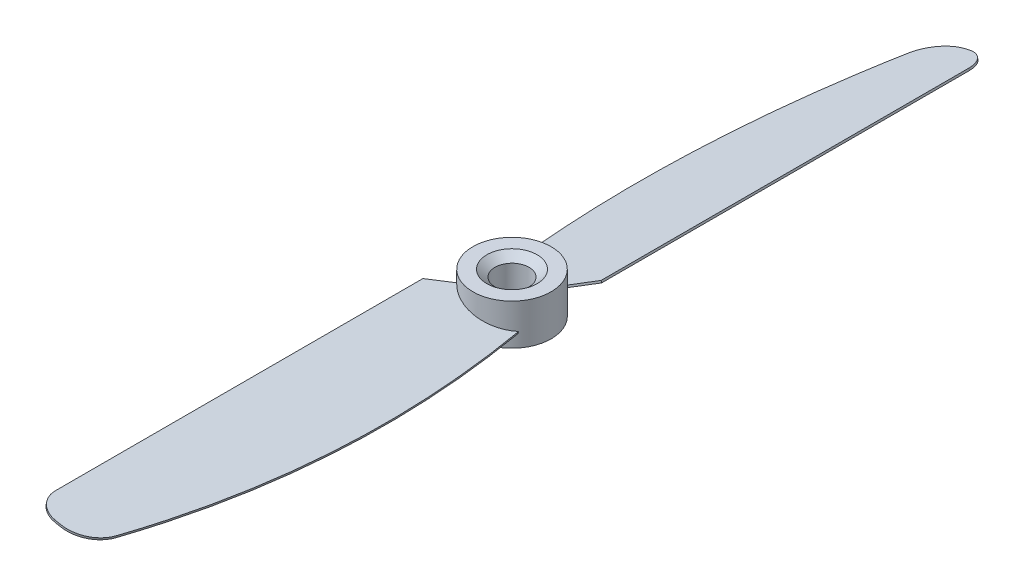
ISO-10303-21;
HEADER;
FILE_DESCRIPTION(('STEP AP214'),'2;1');
FILE_NAME('part.step','',(''),(''),'','','');
FILE_SCHEMA(('AUTOMOTIVE_DESIGN { 1 0 10303 214 1 1 1 1 }'));
ENDSEC;
DATA;
#1=APPLICATION_CONTEXT('core data for automotive mechanical design processes');
#2=APPLICATION_PROTOCOL_DEFINITION('international standard','automotive_design',2000,#1);
#3=PRODUCT_CONTEXT('',#1,'mechanical');
#4=PRODUCT('Part','Part','',(#3));
#5=PRODUCT_RELATED_PRODUCT_CATEGORY('part','',(#4));
#6=PRODUCT_DEFINITION_FORMATION('','',#4);
#7=PRODUCT_DEFINITION_CONTEXT('part definition',#1,'design');
#8=PRODUCT_DEFINITION('design','',#6,#7);
#9=PRODUCT_DEFINITION_SHAPE('','',#8);
#10=(LENGTH_UNIT() NAMED_UNIT(*) SI_UNIT(.MILLI.,.METRE.));
#11=(NAMED_UNIT(*) PLANE_ANGLE_UNIT() SI_UNIT($,.RADIAN.));
#12=(NAMED_UNIT(*) SI_UNIT($,.STERADIAN.) SOLID_ANGLE_UNIT());
#13=UNCERTAINTY_MEASURE_WITH_UNIT(LENGTH_MEASURE(1.E-05),#10,'distance_accuracy_value','');
#14=(GEOMETRIC_REPRESENTATION_CONTEXT(3) GLOBAL_UNCERTAINTY_ASSIGNED_CONTEXT((#13)) GLOBAL_UNIT_ASSIGNED_CONTEXT((#10,
#11,#12)) REPRESENTATION_CONTEXT('',''));
#15=CARTESIAN_POINT('',(0.,0.,0.));
#16=DIRECTION('',(0.,0.,1.));
#17=DIRECTION('',(1.,0.,0.));
#18=AXIS2_PLACEMENT_3D('',#15,#16,#17);
#19=CARTESIAN_POINT('',(0.,3.,0.));
#20=DIRECTION('',(0.,-1.,0.));
#21=DIRECTION('',(0.,0.,-1.));
#22=AXIS2_PLACEMENT_3D('',#19,#20,#21);
#23=CYLINDRICAL_SURFACE('',#22,5.75);
#24=CARTESIAN_POINT('',(0.,-3.,0.));
#25=DIRECTION('',(0.,1.,0.));
#26=DIRECTION('',(0.,0.,1.));
#27=AXIS2_PLACEMENT_3D('',#24,#25,#26);
#28=CIRCLE('',#27,5.75);
#29=CARTESIAN_POINT('',(0.,-3.,5.75));
#30=VERTEX_POINT('',#29);
#31=EDGE_CURVE('E383',#30,#30,#28,.T.);
#32=ORIENTED_EDGE('',*,*,#31,.T.);
#33=EDGE_LOOP('',(#32));
#34=FACE_BOUND('',#33,.T.);
#35=CARTESIAN_POINT('',(0.,3.,0.));
#36=DIRECTION('',(0.,1.,0.));
#37=DIRECTION('',(0.,0.,1.));
#38=AXIS2_PLACEMENT_3D('',#35,#36,#37);
#39=CIRCLE('',#38,5.75);
#40=CARTESIAN_POINT('',(0.,3.,5.75));
#41=VERTEX_POINT('',#40);
#42=EDGE_CURVE('E384',#41,#41,#39,.T.);
#43=ORIENTED_EDGE('',*,*,#42,.F.);
#44=EDGE_LOOP('',(#43));
#45=FACE_BOUND('',#44,.T.);
#46=CARTESIAN_POINT('',(4.46443111139902,-1.18464075126239,3.62372113325136));
#47=CARTESIAN_POINT('',(4.47397422596977,-1.13549059565433,3.61196523042815));
#48=CARTESIAN_POINT('',(4.48350059018282,-1.08635564882995,3.60013321647103));
#49=CARTESIAN_POINT('',(4.5025198178935,-0.988116172748509,3.57631696628896));
#50=CARTESIAN_POINT('',(4.51201268139114,-0.939011643491459,3.56433273006402));
#51=CARTESIAN_POINT('',(4.52148879453108,-0.889922323018077,3.55227238270517));
#52=B_SPLINE_CURVE_WITH_KNOTS('',3,(#46,#47,#48,#49,#50,#51),.UNSPECIFIED.,.F.,.F.,(4,2,4),(0.,
0.154288432876637,0.308576865753275),.UNSPECIFIED.);
#53=CARTESIAN_POINT('',(4.46443111139902,-1.18464075126239,3.62372113325136));
#54=VERTEX_POINT('',#53);
#55=CARTESIAN_POINT('',(4.5214887945304,-0.889922323018731,3.55227238270177));
#56=VERTEX_POINT('',#55);
#57=EDGE_CURVE('E290',#54,#56,#52,.T.);
#58=ORIENTED_EDGE('',*,*,#57,.F.);
#59=CARTESIAN_POINT('',(0.,-0.153945616169009,0.));
#60=DIRECTION('',(-0.224951054343865,-0.974370064785235,0.));
#61=DIRECTION('',(0.974370064785235,-0.224951054343865,0.));
#62=AXIS2_PLACEMENT_3D('',#59,#60,#61);
#63=ELLIPSE('',#62,5.901248619812,5.75);
#64=CARTESIAN_POINT('',(-4.24349922456327,0.825743373848645,3.88010493815965));
#65=VERTEX_POINT('',#64);
#66=EDGE_CURVE('E300',#54,#65,#63,.T.);
#67=ORIENTED_EDGE('',*,*,#66,.T.);
#68=CARTESIAN_POINT('',(0.,1.957694841855,0.));
#69=DIRECTION('',(0.688983680194812,-0.15906441596161,0.707106781186551));
#70=DIRECTION('',(-0.111006093354591,-0.987268206504591,-0.113926009599915));
#71=AXIS2_PLACEMENT_3D('',#68,#69,#70);
#72=ELLIPSE('',#71,36.1488769517612,5.75);
#73=CARTESIAN_POINT('',(-4.21068616320374,1.12605911406529,3.91568921583476));
#74=VERTEX_POINT('',#73);
#75=EDGE_CURVE('E301',#74,#65,#72,.T.);
#76=ORIENTED_EDGE('',*,*,#75,.F.);
#77=CARTESIAN_POINT('',(0.,0.153945616169009,0.));
#78=DIRECTION('',(-0.224951054343865,-0.974370064785235,0.));
#79=DIRECTION('',(0.974370064785235,-0.224951054343865,0.));
#80=AXIS2_PLACEMENT_3D('',#77,#78,#79);
#81=ELLIPSE('',#80,5.901248619812,5.75);
#82=EDGE_CURVE('E388',#56,#74,#81,.T.);
#83=ORIENTED_EDGE('',*,*,#82,.F.);
#84=EDGE_LOOP('',(#58,#67,#76,#83));
#85=FACE_BOUND('',#84,.T.);
#86=CARTESIAN_POINT('',(-4.46443111139902,-1.18464075126239,-3.62372113325136));
#87=CARTESIAN_POINT('',(-4.47397422596977,-1.13549059565433,-3.61196523042815));
#88=CARTESIAN_POINT('',(-4.48350059018282,-1.08635564882995,-3.60013321647103));
#89=CARTESIAN_POINT('',(-4.5025198178935,-0.988116172748509,-3.57631696628896));
#90=CARTESIAN_POINT('',(-4.51201268139114,-0.939011643491459,-3.56433273006402));
#91=CARTESIAN_POINT('',(-4.52148879453108,-0.889922323018077,-3.55227238270517));
#92=B_SPLINE_CURVE_WITH_KNOTS('',3,(#86,#87,#88,#89,#90,#91),.UNSPECIFIED.,.F.,.F.,(4,2,4),(0.,
0.154288432876637,0.308576865753275),.UNSPECIFIED.);
#93=CARTESIAN_POINT('',(-4.46443111139902,-1.18464075126239,-3.62372113325136));
#94=VERTEX_POINT('',#93);
#95=CARTESIAN_POINT('',(-4.5214887945304,-0.889922323018731,-3.55227238270177));
#96=VERTEX_POINT('',#95);
#97=EDGE_CURVE('E55',#94,#96,#92,.T.);
#98=ORIENTED_EDGE('',*,*,#97,.F.);
#99=CARTESIAN_POINT('',(0.,-0.153945616169009,0.));
#100=DIRECTION('',(0.224951054343865,-0.974370064785235,0.));
#101=DIRECTION('',(-0.974370064785235,-0.224951054343865,0.));
#102=AXIS2_PLACEMENT_3D('',#99,#100,#101);
#103=ELLIPSE('',#102,5.901248619812,5.75);
#104=CARTESIAN_POINT('',(4.24349922456327,0.825743373848657,-3.88010493815965));
#105=VERTEX_POINT('',#104);
#106=EDGE_CURVE('E59',#94,#105,#103,.T.);
#107=ORIENTED_EDGE('',*,*,#106,.T.);
#108=CARTESIAN_POINT('',(0.,1.957694841855,0.));
#109=DIRECTION('',(-0.688983680194812,-0.15906441596161,-0.707106781186551));
#110=DIRECTION('',(0.111006093354591,-0.987268206504591,0.113926009599915));
#111=AXIS2_PLACEMENT_3D('',#108,#109,#110);
#112=ELLIPSE('',#111,36.1488769517612,5.75);
#113=CARTESIAN_POINT('',(4.21068616320374,1.12605911406529,-3.91568921583476));
#114=VERTEX_POINT('',#113);
#115=EDGE_CURVE('E136',#114,#105,#112,.T.);
#116=ORIENTED_EDGE('',*,*,#115,.F.);
#117=CARTESIAN_POINT('',(0.,0.153945616169009,0.));
#118=DIRECTION('',(0.224951054343865,-0.974370064785235,0.));
#119=DIRECTION('',(-0.974370064785235,-0.224951054343865,0.));
#120=AXIS2_PLACEMENT_3D('',#117,#118,#119);
#121=ELLIPSE('',#120,5.901248619812,5.75);
#122=EDGE_CURVE('E138',#96,#114,#121,.T.);
#123=ORIENTED_EDGE('',*,*,#122,.F.);
#124=EDGE_LOOP('',(#98,#107,#116,#123));
#125=FACE_BOUND('',#124,.T.);
#126=ADVANCED_FACE('F39',(#34,#45,#85,#125),#23,.T.);
#127=CARTESIAN_POINT('',(0.,3.,0.));
#128=DIRECTION('',(0.,1.,0.));
#129=DIRECTION('',(0.,0.,1.));
#130=AXIS2_PLACEMENT_3D('',#127,#128,#129);
#131=PLANE('',#130);
#132=CARTESIAN_POINT('',(0.,3.,0.));
#133=DIRECTION('',(0.,1.,0.));
#134=DIRECTION('',(0.,0.,1.));
#135=AXIS2_PLACEMENT_3D('',#132,#133,#134);
#136=CIRCLE('',#135,3.69175359259419);
#137=CARTESIAN_POINT('',(0.,3.,3.69175359259419));
#138=VERTEX_POINT('',#137);
#139=EDGE_CURVE('E11',#138,#138,#136,.F.);
#140=ORIENTED_EDGE('',*,*,#139,.T.);
#141=EDGE_LOOP('',(#140));
#142=FACE_BOUND('',#141,.T.);
#143=ORIENTED_EDGE('',*,*,#42,.T.);
#144=EDGE_LOOP('',(#143));
#145=FACE_BOUND('',#144,.T.);
#146=ADVANCED_FACE('F275',(#142,#145),#131,.T.);
#147=CARTESIAN_POINT('',(0.,-3.,0.));
#148=DIRECTION('',(0.,1.,0.));
#149=DIRECTION('',(0.,0.,1.));
#150=AXIS2_PLACEMENT_3D('',#147,#148,#149);
#151=PLANE('',#150);
#152=CARTESIAN_POINT('',(0.,-3.,0.));
#153=DIRECTION('',(0.,1.,0.));
#154=DIRECTION('',(0.,0.,1.));
#155=AXIS2_PLACEMENT_3D('',#152,#153,#154);
#156=CIRCLE('',#155,3.49999999999999);
#157=CARTESIAN_POINT('',(0.,-3.,3.49999999999999));
#158=VERTEX_POINT('',#157);
#159=EDGE_CURVE('E48',#158,#158,#156,.T.);
#160=ORIENTED_EDGE('',*,*,#159,.T.);
#161=EDGE_LOOP('',(#160));
#162=FACE_BOUND('',#161,.T.);
#163=ORIENTED_EDGE('',*,*,#31,.F.);
#164=EDGE_LOOP('',(#163));
#165=FACE_BOUND('',#164,.T.);
#166=ADVANCED_FACE('F281',(#162,#165),#151,.F.);
#167=CARTESIAN_POINT('',(4.25834315477571,-1.137061597504,2.25349369782339));
#168=CARTESIAN_POINT('',(8.76564898636963,-2.17765514169379,31.313089236957));
#169=CARTESIAN_POINT('',(1.58492122862016,-0.519853513297051,59.69801472573));
#170=B_SPLINE_CURVE_WITH_KNOTS('',2,(#167,#168,#169),.UNSPECIFIED.,.F.,.F.,(3,3),(0.,1.),.UNSPECIFIED.);
#171=DIRECTION('',(0.224951054343865,0.974370064785235,0.));
#172=VECTOR('',#171,1.);
#173=SURFACE_OF_LINEAR_EXTRUSION('',#170,#172);
#174=CARTESIAN_POINT('',(1.58492122862016,-0.519853513297051,59.69801472573));
#175=VERTEX_POINT('',#174);
#176=EDGE_CURVE('E225',#54,#175,#170,.T.);
#177=ORIENTED_EDGE('',*,*,#176,.F.);
#178=ORIENTED_EDGE('',*,*,#57,.T.);
#179=CARTESIAN_POINT('',(4.32582847107887,-0.844750578068432,2.25349369782339));
#180=CARTESIAN_POINT('',(8.83313430267279,-1.88534412225822,31.313089236957));
#181=CARTESIAN_POINT('',(1.65240654492332,-0.22754249386148,59.69801472573));
#182=B_SPLINE_CURVE_WITH_KNOTS('',2,(#179,#180,#181),.UNSPECIFIED.,.F.,.F.,(3,3),(0.,1.),.UNSPECIFIED.);
#183=CARTESIAN_POINT('',(1.65240654492332,-0.227542493861481,59.69801472573));
#184=VERTEX_POINT('',#183);
#185=EDGE_CURVE('E224',#56,#184,#182,.T.);
#186=ORIENTED_EDGE('',*,*,#185,.T.);
#187=DIRECTION('',(0.224951054343865,0.974370064785235,0.));
#188=VECTOR('',#187,1.);
#189=CARTESIAN_POINT('',(1.58492122862016,-0.519853513297051,59.69801472573));
#190=LINE('',#189,#188);
#191=EDGE_CURVE('E348',#175,#184,#190,.T.);
#192=ORIENTED_EDGE('',*,*,#191,.F.);
#193=EDGE_LOOP('',(#177,#178,#186,#192));
#194=FACE_BOUND('',#193,.T.);
#195=ADVANCED_FACE('F304',(#194),#173,.F.);
#196=CARTESIAN_POINT('',(-3.14501679168089,0.572138721585881,58.5));
#197=DIRECTION('',(0.224951054343865,0.974370064785235,0.));
#198=DIRECTION('',(-0.974370064785235,0.224951054343865,0.));
#199=AXIS2_PLACEMENT_3D('',#196,#197,#198);
#200=CYLINDRICAL_SURFACE('',#199,5.);
#201=CARTESIAN_POINT('',(-3.07753147537773,0.864449741021451,58.5));
#202=DIRECTION('',(-0.224951054343865,-0.974370064785235,0.));
#203=DIRECTION('',(0.974370064785235,-0.224951054343865,0.));
#204=AXIS2_PLACEMENT_3D('',#201,#202,#203);
#205=CIRCLE('',#204,5.);
#206=CARTESIAN_POINT('',(-3.07753147537773,0.864449741021452,63.5));
#207=VERTEX_POINT('',#206);
#208=EDGE_CURVE('E406',#184,#207,#205,.T.);
#209=ORIENTED_EDGE('',*,*,#208,.T.);
#210=DIRECTION('',(0.224951054343865,0.974370064785235,0.));
#211=VECTOR('',#210,1.);
#212=CARTESIAN_POINT('',(-3.14501679168089,0.572138721585881,63.5));
#213=LINE('',#212,#211);
#214=CARTESIAN_POINT('',(-3.14501679168089,0.572138721585881,63.5));
#215=VERTEX_POINT('',#214);
#216=EDGE_CURVE('E377',#215,#207,#213,.T.);
#217=ORIENTED_EDGE('',*,*,#216,.F.);
#218=CARTESIAN_POINT('',(-3.14501679168089,0.572138721585881,58.5));
#219=DIRECTION('',(-0.224951054343865,-0.974370064785235,0.));
#220=DIRECTION('',(0.974370064785235,-0.224951054343865,0.));
#221=AXIS2_PLACEMENT_3D('',#218,#219,#220);
#222=CIRCLE('',#221,5.);
#223=EDGE_CURVE('E351',#175,#215,#222,.T.);
#224=ORIENTED_EDGE('',*,*,#223,.F.);
#225=ORIENTED_EDGE('',*,*,#191,.T.);
#226=EDGE_LOOP('',(#209,#217,#224,#225));
#227=FACE_BOUND('',#226,.T.);
#228=ADVANCED_FACE('F308',(#227),#200,.T.);
#229=CARTESIAN_POINT('',(-3.81241556843364,0.726219869934203,63.5));
#230=DIRECTION('',(0.,0.,-1.));
#231=DIRECTION('',(-1.,0.,0.));
#232=AXIS2_PLACEMENT_3D('',#229,#230,#231);
#233=PLANE('',#232);
#234=DIRECTION('',(-0.974370064785235,0.224951054343865,0.));
#235=VECTOR('',#234,1.);
#236=CARTESIAN_POINT('',(-3.74493025213048,1.01853088936977,63.5));
#237=LINE('',#236,#235);
#238=CARTESIAN_POINT('',(-3.74493025213048,1.01853088936977,63.5));
#239=VERTEX_POINT('',#238);
#240=EDGE_CURVE('E412',#207,#239,#237,.T.);
#241=ORIENTED_EDGE('',*,*,#240,.T.);
#242=DIRECTION('',(0.224951054343865,0.974370064785235,0.));
#243=VECTOR('',#242,1.);
#244=CARTESIAN_POINT('',(-3.81241556843364,0.726219869934203,63.5));
#245=LINE('',#244,#243);
#246=CARTESIAN_POINT('',(-3.81241556843364,0.726219869934203,63.5));
#247=VERTEX_POINT('',#246);
#248=EDGE_CURVE('E373',#247,#239,#245,.T.);
#249=ORIENTED_EDGE('',*,*,#248,.F.);
#250=DIRECTION('',(-0.974370064785235,0.224951054343865,0.));
#251=VECTOR('',#250,1.);
#252=CARTESIAN_POINT('',(-3.81241556843364,0.726219869934203,63.5));
#253=LINE('',#252,#251);
#254=EDGE_CURVE('E355',#215,#247,#253,.T.);
#255=ORIENTED_EDGE('',*,*,#254,.F.);
#256=ORIENTED_EDGE('',*,*,#216,.T.);
#257=EDGE_LOOP('',(#241,#249,#255,#256));
#258=FACE_BOUND('',#257,.T.);
#259=ADVANCED_FACE('F312',(#258),#233,.F.);
#260=CARTESIAN_POINT('',(-3.81241556843366,0.726219869934208,60.5));
#261=DIRECTION('',(0.224951054343865,0.974370064785235,0.));
#262=DIRECTION('',(-0.974370064785235,0.224951054343865,0.));
#263=AXIS2_PLACEMENT_3D('',#260,#261,#262);
#264=CYLINDRICAL_SURFACE('',#263,3.);
#265=CARTESIAN_POINT('',(-3.7449302521305,1.01853088936978,60.5));
#266=DIRECTION('',(-0.224951054343865,-0.974370064785235,0.));
#267=DIRECTION('',(-0.974370064785235,0.224951054343865,0.));
#268=AXIS2_PLACEMENT_3D('',#265,#266,#267);
#269=CIRCLE('',#268,3.);
#270=CARTESIAN_POINT('',(-6.66804044648621,1.69338405240138,60.5));
#271=VERTEX_POINT('',#270);
#272=EDGE_CURVE('E362',#239,#271,#269,.T.);
#273=ORIENTED_EDGE('',*,*,#272,.T.);
#274=DIRECTION('',(0.224951054343865,0.974370064785235,0.));
#275=VECTOR('',#274,1.);
#276=CARTESIAN_POINT('',(-6.73552576278937,1.4010730329658,60.5));
#277=LINE('',#276,#275);
#278=CARTESIAN_POINT('',(-6.73552576278937,1.4010730329658,60.5));
#279=VERTEX_POINT('',#278);
#280=EDGE_CURVE('E369',#279,#271,#277,.T.);
#281=ORIENTED_EDGE('',*,*,#280,.F.);
#282=CARTESIAN_POINT('',(-3.81241556843366,0.726219869934208,60.5));
#283=DIRECTION('',(-0.224951054343865,-0.974370064785235,0.));
#284=DIRECTION('',(-0.974370064785235,0.224951054343865,0.));
#285=AXIS2_PLACEMENT_3D('',#282,#283,#284);
#286=CIRCLE('',#285,3.);
#287=EDGE_CURVE('E398',#247,#279,#286,.T.);
#288=ORIENTED_EDGE('',*,*,#287,.F.);
#289=ORIENTED_EDGE('',*,*,#248,.T.);
#290=EDGE_LOOP('',(#273,#281,#288,#289));
#291=FACE_BOUND('',#290,.T.);
#292=ADVANCED_FACE('F316',(#291),#264,.T.);
#293=CARTESIAN_POINT('',(-6.73552576278938,1.40107303296581,6.43768201107123));
#294=DIRECTION('',(0.974370064785235,-0.224951054343865,0.));
#295=DIRECTION('',(0.224951054343865,0.974370064785235,0.));
#296=AXIS2_PLACEMENT_3D('',#293,#294,#295);
#297=PLANE('',#296);
#298=DIRECTION('',(0.,0.,-1.));
#299=VECTOR('',#298,1.);
#300=CARTESIAN_POINT('',(-6.66804044648622,1.69338405240138,6.43768201107123));
#301=LINE('',#300,#299);
#302=CARTESIAN_POINT('',(-6.66804044648622,1.69338405240138,6.43768201107123));
#303=VERTEX_POINT('',#302);
#304=EDGE_CURVE('E357',#271,#303,#301,.T.);
#305=ORIENTED_EDGE('',*,*,#304,.T.);
#306=DIRECTION('',(0.224951054343865,0.974370064785235,0.));
#307=VECTOR('',#306,1.);
#308=CARTESIAN_POINT('',(-6.73552576278938,1.40107303296581,6.43768201107123));
#309=LINE('',#308,#307);
#310=CARTESIAN_POINT('',(-6.73552576278938,1.40107303296581,6.43768201107123));
#311=VERTEX_POINT('',#310);
#312=EDGE_CURVE('E366',#311,#303,#309,.T.);
#313=ORIENTED_EDGE('',*,*,#312,.F.);
#314=DIRECTION('',(0.,0.,-1.));
#315=VECTOR('',#314,1.);
#316=CARTESIAN_POINT('',(-6.73552576278938,1.40107303296581,6.43768201107123));
#317=LINE('',#316,#315);
#318=EDGE_CURVE('E395',#279,#311,#317,.T.);
#319=ORIENTED_EDGE('',*,*,#318,.F.);
#320=ORIENTED_EDGE('',*,*,#280,.T.);
#321=EDGE_LOOP('',(#305,#313,#319,#320));
#322=FACE_BOUND('',#321,.T.);
#323=ADVANCED_FACE('F320',(#322),#297,.F.);
#324=CARTESIAN_POINT('',(-3.77739958746584,0.71813579374768,3.40174496596556));
#325=DIRECTION('',(0.688983680194812,-0.15906441596161,0.707106781186551));
#326=DIRECTION('',(0.716225617849128,0.,-0.697868801664493));
#327=AXIS2_PLACEMENT_3D('',#324,#325,#326);
#328=PLANE('',#327);
#329=DIRECTION('',(0.688983680194819,-0.159064415961612,-0.707106781186544));
#330=VECTOR('',#329,1.);
#331=CARTESIAN_POINT('',(-3.70991427116268,1.01044681318325,3.40174496596556));
#332=LINE('',#331,#330);
#333=EDGE_CURVE('E352',#303,#74,#332,.T.);
#334=ORIENTED_EDGE('',*,*,#333,.T.);
#335=ORIENTED_EDGE('',*,*,#75,.T.);
#336=DIRECTION('',(0.688983680194819,-0.159064415961612,-0.707106781186544));
#337=VECTOR('',#336,1.);
#338=CARTESIAN_POINT('',(-3.77739958746584,0.71813579374768,3.40174496596556));
#339=LINE('',#338,#337);
#340=EDGE_CURVE('E341',#311,#65,#339,.T.);
#341=ORIENTED_EDGE('',*,*,#340,.F.);
#342=ORIENTED_EDGE('',*,*,#312,.T.);
#343=EDGE_LOOP('',(#334,#335,#341,#342));
#344=FACE_BOUND('',#343,.T.);
#345=ADVANCED_FACE('F324',(#344),#328,.F.);
#346=CARTESIAN_POINT('',(0.301534975259367,-0.22356045046823,5.06414863914401));
#347=DIRECTION('',(-0.224951054343865,-0.974370064785235,0.));
#348=DIRECTION('',(0.974370064785235,-0.224951054343865,0.));
#349=AXIS2_PLACEMENT_3D('',#346,#347,#348);
#350=PLANE('',#349);
#351=ORIENTED_EDGE('',*,*,#66,.F.);
#352=ORIENTED_EDGE('',*,*,#176,.T.);
#353=ORIENTED_EDGE('',*,*,#223,.T.);
#354=ORIENTED_EDGE('',*,*,#254,.T.);
#355=ORIENTED_EDGE('',*,*,#287,.T.);
#356=ORIENTED_EDGE('',*,*,#318,.T.);
#357=ORIENTED_EDGE('',*,*,#340,.T.);
#358=EDGE_LOOP('',(#351,#352,#353,#354,#355,#356,#357));
#359=FACE_BOUND('',#358,.T.);
#360=ADVANCED_FACE('F328',(#359),#350,.T.);
#361=CARTESIAN_POINT('',(0.369020291562526,0.0687505689673402,5.06414863914401));
#362=DIRECTION('',(-0.224951054343865,-0.974370064785235,0.));
#363=DIRECTION('',(0.974370064785235,-0.224951054343865,0.));
#364=AXIS2_PLACEMENT_3D('',#361,#362,#363);
#365=PLANE('',#364);
#366=ORIENTED_EDGE('',*,*,#185,.F.);
#367=ORIENTED_EDGE('',*,*,#82,.T.);
#368=ORIENTED_EDGE('',*,*,#333,.F.);
#369=ORIENTED_EDGE('',*,*,#304,.F.);
#370=ORIENTED_EDGE('',*,*,#272,.F.);
#371=ORIENTED_EDGE('',*,*,#240,.F.);
#372=ORIENTED_EDGE('',*,*,#208,.F.);
#373=EDGE_LOOP('',(#366,#367,#368,#369,#370,#371,#372));
#374=FACE_BOUND('',#373,.T.);
#375=ADVANCED_FACE('F238',(#374),#365,.F.);
#376=CARTESIAN_POINT('',(-4.25834315477571,-1.137061597504,-2.25349369782339));
#377=CARTESIAN_POINT('',(-8.76564898636963,-2.17765514169379,-31.313089236957));
#378=CARTESIAN_POINT('',(-1.58492122862016,-0.519853513297051,-59.69801472573));
#379=B_SPLINE_CURVE_WITH_KNOTS('',2,(#376,#377,#378),.UNSPECIFIED.,.F.,.F.,(3,3),(0.,1.),.UNSPECIFIED.);
#380=DIRECTION('',(-0.224951054343865,0.974370064785235,0.));
#381=VECTOR('',#380,1.);
#382=SURFACE_OF_LINEAR_EXTRUSION('',#379,#381);
#383=CARTESIAN_POINT('',(-1.58492122862016,-0.519853513297051,-59.69801472573));
#384=VERTEX_POINT('',#383);
#385=EDGE_CURVE('E186',#94,#384,#379,.T.);
#386=ORIENTED_EDGE('',*,*,#385,.F.);
#387=ORIENTED_EDGE('',*,*,#97,.T.);
#388=CARTESIAN_POINT('',(-4.32582847107887,-0.844750578068432,-2.25349369782339));
#389=CARTESIAN_POINT('',(-8.83313430267279,-1.88534412225822,-31.313089236957));
#390=CARTESIAN_POINT('',(-1.65240654492332,-0.22754249386148,-59.69801472573));
#391=B_SPLINE_CURVE_WITH_KNOTS('',2,(#388,#389,#390),.UNSPECIFIED.,.F.,.F.,(3,3),(0.,1.),.UNSPECIFIED.);
#392=CARTESIAN_POINT('',(-1.65240654492332,-0.227542493861481,-59.69801472573));
#393=VERTEX_POINT('',#392);
#394=EDGE_CURVE('E152',#96,#393,#391,.T.);
#395=ORIENTED_EDGE('',*,*,#394,.T.);
#396=DIRECTION('',(-0.224951054343865,0.974370064785235,0.));
#397=VECTOR('',#396,1.);
#398=CARTESIAN_POINT('',(-1.58492122862016,-0.519853513297051,-59.69801472573));
#399=LINE('',#398,#397);
#400=EDGE_CURVE('E212',#384,#393,#399,.T.);
#401=ORIENTED_EDGE('',*,*,#400,.F.);
#402=EDGE_LOOP('',(#386,#387,#395,#401));
#403=FACE_BOUND('',#402,.T.);
#404=ADVANCED_FACE('F232',(#403),#382,.F.);
#405=CARTESIAN_POINT('',(3.14501679168089,0.572138721585881,-58.5));
#406=DIRECTION('',(-0.224951054343865,0.974370064785235,0.));
#407=DIRECTION('',(0.974370064785235,0.224951054343865,0.));
#408=AXIS2_PLACEMENT_3D('',#405,#406,#407);
#409=CYLINDRICAL_SURFACE('',#408,5.);
#410=CARTESIAN_POINT('',(3.07753147537773,0.864449741021451,-58.5));
#411=DIRECTION('',(0.224951054343865,-0.974370064785235,0.));
#412=DIRECTION('',(-0.974370064785235,-0.224951054343865,0.));
#413=AXIS2_PLACEMENT_3D('',#410,#411,#412);
#414=CIRCLE('',#413,5.);
#415=CARTESIAN_POINT('',(3.07753147537773,0.864449741021452,-63.5));
#416=VERTEX_POINT('',#415);
#417=EDGE_CURVE('E145',#393,#416,#414,.T.);
#418=ORIENTED_EDGE('',*,*,#417,.T.);
#419=DIRECTION('',(-0.224951054343865,0.974370064785235,0.));
#420=VECTOR('',#419,1.);
#421=CARTESIAN_POINT('',(3.14501679168089,0.572138721585881,-63.5));
#422=LINE('',#421,#420);
#423=CARTESIAN_POINT('',(3.14501679168089,0.572138721585881,-63.5));
#424=VERTEX_POINT('',#423);
#425=EDGE_CURVE('E208',#424,#416,#422,.T.);
#426=ORIENTED_EDGE('',*,*,#425,.F.);
#427=CARTESIAN_POINT('',(3.14501679168089,0.572138721585881,-58.5));
#428=DIRECTION('',(0.224951054343865,-0.974370064785235,0.));
#429=DIRECTION('',(-0.974370064785235,-0.224951054343865,0.));
#430=AXIS2_PLACEMENT_3D('',#427,#428,#429);
#431=CIRCLE('',#430,5.);
#432=EDGE_CURVE('E187',#384,#424,#431,.T.);
#433=ORIENTED_EDGE('',*,*,#432,.F.);
#434=ORIENTED_EDGE('',*,*,#400,.T.);
#435=EDGE_LOOP('',(#418,#426,#433,#434));
#436=FACE_BOUND('',#435,.T.);
#437=ADVANCED_FACE('F237',(#436),#409,.T.);
#438=CARTESIAN_POINT('',(3.81241556843364,0.726219869934203,-63.5));
#439=DIRECTION('',(0.,0.,1.));
#440=DIRECTION('',(1.,0.,0.));
#441=AXIS2_PLACEMENT_3D('',#438,#439,#440);
#442=PLANE('',#441);
#443=DIRECTION('',(0.974370064785235,0.224951054343865,0.));
#444=VECTOR('',#443,1.);
#445=CARTESIAN_POINT('',(3.74493025213048,1.01853088936977,-63.5));
#446=LINE('',#445,#444);
#447=CARTESIAN_POINT('',(3.74493025213048,1.01853088936977,-63.5));
#448=VERTEX_POINT('',#447);
#449=EDGE_CURVE('E173',#416,#448,#446,.T.);
#450=ORIENTED_EDGE('',*,*,#449,.T.);
#451=DIRECTION('',(-0.224951054343865,0.974370064785235,0.));
#452=VECTOR('',#451,1.);
#453=CARTESIAN_POINT('',(3.81241556843364,0.726219869934203,-63.5));
#454=LINE('',#453,#452);
#455=CARTESIAN_POINT('',(3.81241556843364,0.726219869934203,-63.5));
#456=VERTEX_POINT('',#455);
#457=EDGE_CURVE('E204',#456,#448,#454,.T.);
#458=ORIENTED_EDGE('',*,*,#457,.F.);
#459=DIRECTION('',(0.974370064785235,0.224951054343865,0.));
#460=VECTOR('',#459,1.);
#461=CARTESIAN_POINT('',(3.81241556843364,0.726219869934203,-63.5));
#462=LINE('',#461,#460);
#463=EDGE_CURVE('E190',#424,#456,#462,.T.);
#464=ORIENTED_EDGE('',*,*,#463,.F.);
#465=ORIENTED_EDGE('',*,*,#425,.T.);
#466=EDGE_LOOP('',(#450,#458,#464,#465));
#467=FACE_BOUND('',#466,.T.);
#468=ADVANCED_FACE('F257',(#467),#442,.F.);
#469=CARTESIAN_POINT('',(3.81241556843366,0.726219869934208,-60.5));
#470=DIRECTION('',(-0.224951054343865,0.974370064785235,0.));
#471=DIRECTION('',(0.974370064785235,0.224951054343865,0.));
#472=AXIS2_PLACEMENT_3D('',#469,#470,#471);
#473=CYLINDRICAL_SURFACE('',#472,3.);
#474=CARTESIAN_POINT('',(3.7449302521305,1.01853088936978,-60.5));
#475=DIRECTION('',(0.224951054343865,-0.974370064785235,0.));
#476=DIRECTION('',(0.974370064785235,0.224951054343865,0.));
#477=AXIS2_PLACEMENT_3D('',#474,#475,#476);
#478=CIRCLE('',#477,3.);
#479=CARTESIAN_POINT('',(6.66804044648621,1.69338405240138,-60.5));
#480=VERTEX_POINT('',#479);
#481=EDGE_CURVE('E164',#448,#480,#478,.T.);
#482=ORIENTED_EDGE('',*,*,#481,.T.);
#483=DIRECTION('',(-0.224951054343865,0.974370064785235,0.));
#484=VECTOR('',#483,1.);
#485=CARTESIAN_POINT('',(6.73552576278937,1.4010730329658,-60.5));
#486=LINE('',#485,#484);
#487=CARTESIAN_POINT('',(6.73552576278937,1.4010730329658,-60.5));
#488=VERTEX_POINT('',#487);
#489=EDGE_CURVE('E200',#488,#480,#486,.T.);
#490=ORIENTED_EDGE('',*,*,#489,.F.);
#491=CARTESIAN_POINT('',(3.81241556843366,0.726219869934208,-60.5));
#492=DIRECTION('',(0.224951054343865,-0.974370064785235,0.));
#493=DIRECTION('',(0.974370064785235,0.224951054343865,0.));
#494=AXIS2_PLACEMENT_3D('',#491,#492,#493);
#495=CIRCLE('',#494,3.);
#496=EDGE_CURVE('E193',#456,#488,#495,.T.);
#497=ORIENTED_EDGE('',*,*,#496,.F.);
#498=ORIENTED_EDGE('',*,*,#457,.T.);
#499=EDGE_LOOP('',(#482,#490,#497,#498));
#500=FACE_BOUND('',#499,.T.);
#501=ADVANCED_FACE('F263',(#500),#473,.T.);
#502=CARTESIAN_POINT('',(6.73552576278938,1.40107303296581,-6.43768201107123));
#503=DIRECTION('',(-0.974370064785235,-0.224951054343865,0.));
#504=DIRECTION('',(-0.224951054343865,0.974370064785235,0.));
#505=AXIS2_PLACEMENT_3D('',#502,#503,#504);
#506=PLANE('',#505);
#507=DIRECTION('',(0.,0.,1.));
#508=VECTOR('',#507,1.);
#509=CARTESIAN_POINT('',(6.66804044648622,1.69338405240138,-6.43768201107123));
#510=LINE('',#509,#508);
#511=CARTESIAN_POINT('',(6.66804044648622,1.69338405240138,-6.43768201107123));
#512=VERTEX_POINT('',#511);
#513=EDGE_CURVE('E160',#480,#512,#510,.T.);
#514=ORIENTED_EDGE('',*,*,#513,.T.);
#515=DIRECTION('',(-0.224951054343865,0.974370064785235,0.));
#516=VECTOR('',#515,1.);
#517=CARTESIAN_POINT('',(6.73552576278938,1.40107303296581,-6.43768201107123));
#518=LINE('',#517,#516);
#519=CARTESIAN_POINT('',(6.73552576278938,1.40107303296581,-6.43768201107123));
#520=VERTEX_POINT('',#519);
#521=EDGE_CURVE('E158',#520,#512,#518,.T.);
#522=ORIENTED_EDGE('',*,*,#521,.F.);
#523=DIRECTION('',(0.,0.,1.));
#524=VECTOR('',#523,1.);
#525=CARTESIAN_POINT('',(6.73552576278938,1.40107303296581,-6.43768201107123));
#526=LINE('',#525,#524);
#527=EDGE_CURVE('E196',#488,#520,#526,.T.);
#528=ORIENTED_EDGE('',*,*,#527,.F.);
#529=ORIENTED_EDGE('',*,*,#489,.T.);
#530=EDGE_LOOP('',(#514,#522,#528,#529));
#531=FACE_BOUND('',#530,.T.);
#532=ADVANCED_FACE('F265',(#531),#506,.F.);
#533=CARTESIAN_POINT('',(-0.301534975259367,-0.22356045046823,-5.06414863914401));
#534=DIRECTION('',(0.224951054343865,-0.974370064785235,0.));
#535=DIRECTION('',(-0.974370064785235,-0.224951054343865,0.));
#536=AXIS2_PLACEMENT_3D('',#533,#534,#535);
#537=PLANE('',#536);
#538=ORIENTED_EDGE('',*,*,#106,.F.);
#539=ORIENTED_EDGE('',*,*,#385,.T.);
#540=ORIENTED_EDGE('',*,*,#432,.T.);
#541=ORIENTED_EDGE('',*,*,#463,.T.);
#542=ORIENTED_EDGE('',*,*,#496,.T.);
#543=ORIENTED_EDGE('',*,*,#527,.T.);
#544=DIRECTION('',(-0.688983680194819,-0.159064415961612,0.707106781186544));
#545=VECTOR('',#544,1.);
#546=CARTESIAN_POINT('',(3.77739958746584,0.71813579374768,-3.40174496596556));
#547=LINE('',#546,#545);
#548=EDGE_CURVE('E144',#520,#105,#547,.T.);
#549=ORIENTED_EDGE('',*,*,#548,.T.);
#550=EDGE_LOOP('',(#538,#539,#540,#541,#542,#543,#549));
#551=FACE_BOUND('',#550,.T.);
#552=ADVANCED_FACE('F251',(#551),#537,.T.);
#553=CARTESIAN_POINT('',(3.77739958746584,0.71813579374768,-3.40174496596556));
#554=DIRECTION('',(-0.688983680194812,-0.15906441596161,-0.707106781186551));
#555=DIRECTION('',(-0.716225617849128,0.,0.697868801664493));
#556=AXIS2_PLACEMENT_3D('',#553,#554,#555);
#557=PLANE('',#556);
#558=DIRECTION('',(-0.688983680194819,-0.159064415961612,0.707106781186544));
#559=VECTOR('',#558,1.);
#560=CARTESIAN_POINT('',(3.70991427116268,1.01044681318325,-3.40174496596556));
#561=LINE('',#560,#559);
#562=EDGE_CURVE('E149',#512,#114,#561,.T.);
#563=ORIENTED_EDGE('',*,*,#562,.T.);
#564=ORIENTED_EDGE('',*,*,#115,.T.);
#565=ORIENTED_EDGE('',*,*,#548,.F.);
#566=ORIENTED_EDGE('',*,*,#521,.T.);
#567=EDGE_LOOP('',(#563,#564,#565,#566));
#568=FACE_BOUND('',#567,.T.);
#569=ADVANCED_FACE('F156',(#568),#557,.F.);
#570=CARTESIAN_POINT('',(-0.369020291562526,0.0687505689673402,-5.06414863914401));
#571=DIRECTION('',(0.224951054343865,-0.974370064785235,0.));
#572=DIRECTION('',(-0.974370064785235,-0.224951054343865,0.));
#573=AXIS2_PLACEMENT_3D('',#570,#571,#572);
#574=PLANE('',#573);
#575=ORIENTED_EDGE('',*,*,#394,.F.);
#576=ORIENTED_EDGE('',*,*,#122,.T.);
#577=ORIENTED_EDGE('',*,*,#562,.F.);
#578=ORIENTED_EDGE('',*,*,#513,.F.);
#579=ORIENTED_EDGE('',*,*,#481,.F.);
#580=ORIENTED_EDGE('',*,*,#449,.F.);
#581=ORIENTED_EDGE('',*,*,#417,.F.);
#582=EDGE_LOOP('',(#575,#576,#577,#578,#579,#580,#581));
#583=FACE_BOUND('',#582,.T.);
#584=ADVANCED_FACE('F148',(#583),#574,.F.);
#585=CARTESIAN_POINT('',(0.,3.,0.));
#586=DIRECTION('',(0.,-1.,0.));
#587=DIRECTION('',(0.,0.,-1.));
#588=AXIS2_PLACEMENT_3D('',#585,#586,#587);
#589=CYLINDRICAL_SURFACE('',#588,2.5);
#590=CARTESIAN_POINT('',(0.,-1.80824640740581,0.));
#591=DIRECTION('',(0.,1.,0.));
#592=DIRECTION('',(0.,0.,1.));
#593=AXIS2_PLACEMENT_3D('',#590,#591,#592);
#594=CIRCLE('',#593,2.5);
#595=CARTESIAN_POINT('',(0.,-1.80824640740581,2.5));
#596=VERTEX_POINT('',#595);
#597=EDGE_CURVE('E431',#596,#596,#594,.F.);
#598=ORIENTED_EDGE('',*,*,#597,.T.);
#599=EDGE_LOOP('',(#598));
#600=FACE_BOUND('',#599,.T.);
#601=CARTESIAN_POINT('',(0.,2.,0.));
#602=DIRECTION('',(0.,1.,0.));
#603=DIRECTION('',(0.,0.,1.));
#604=AXIS2_PLACEMENT_3D('',#601,#602,#603);
#605=CIRCLE('',#604,2.5);
#606=CARTESIAN_POINT('',(0.,2.,2.5));
#607=VERTEX_POINT('',#606);
#608=EDGE_CURVE('E345',#607,#607,#605,.T.);
#609=ORIENTED_EDGE('',*,*,#608,.T.);
#610=EDGE_LOOP('',(#609));
#611=FACE_BOUND('',#610,.T.);
#612=ADVANCED_FACE('F442',(#600,#611),#589,.F.);
#613=CARTESIAN_POINT('',(0.,-1.80824640740581,0.));
#614=DIRECTION('',(0.,-1.,0.));
#615=DIRECTION('',(0.,0.,-1.));
#616=AXIS2_PLACEMENT_3D('',#613,#614,#615);
#617=CONICAL_SURFACE('',#616,2.5,0.698131700797734);
#618=ORIENTED_EDGE('',*,*,#159,.F.);
#619=EDGE_LOOP('',(#618));
#620=FACE_BOUND('',#619,.T.);
#621=ORIENTED_EDGE('',*,*,#597,.F.);
#622=EDGE_LOOP('',(#621));
#623=FACE_BOUND('',#622,.T.);
#624=ADVANCED_FACE('F288',(#620,#623),#617,.F.);
#625=CARTESIAN_POINT('',(0.,3.,0.));
#626=DIRECTION('',(0.,1.,0.));
#627=DIRECTION('',(0.,0.,1.));
#628=AXIS2_PLACEMENT_3D('',#625,#626,#627);
#629=CONICAL_SURFACE('',#628,3.69175359259419,0.872664625997157);
#630=ORIENTED_EDGE('',*,*,#608,.F.);
#631=EDGE_LOOP('',(#630));
#632=FACE_BOUND('',#631,.T.);
#633=ORIENTED_EDGE('',*,*,#139,.F.);
#634=EDGE_LOOP('',(#633));
#635=FACE_BOUND('',#634,.T.);
#636=ADVANCED_FACE('F41',(#632,#635),#629,.F.);
#637=CLOSED_SHELL('',(#126,#146,#166,#195,#228,#259,#292,#323,#345,#360,#375,#404,#437,#468,
#501,#532,#552,#569,#584,#612,#624,#636));
#638=MANIFOLD_SOLID_BREP('B2',#637);
#639=ADVANCED_BREP_SHAPE_REPRESENTATION('',(#18,#638),#14);
#640=SHAPE_DEFINITION_REPRESENTATION(#9,#639);
ENDSEC;
END-ISO-10303-21;
